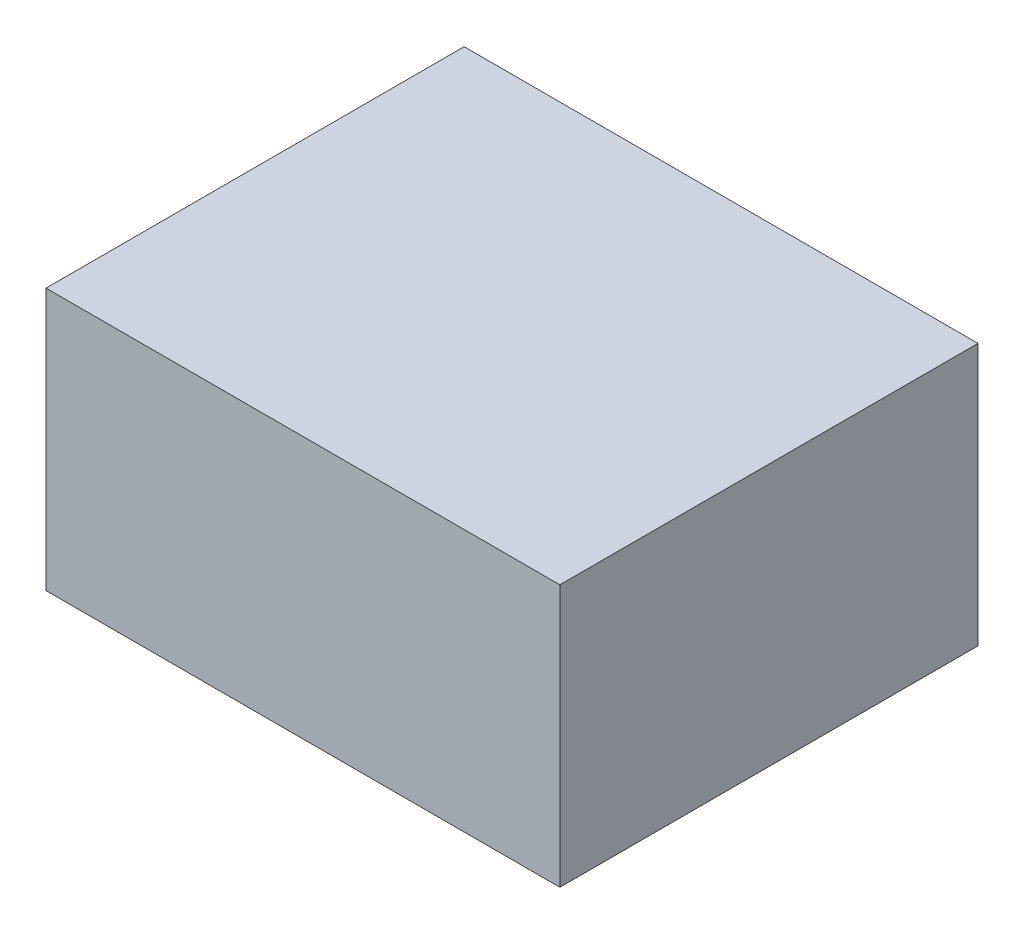
ISO-10303-21;
HEADER;
FILE_DESCRIPTION(('STEP AP214'),'2;1');
FILE_NAME('part.step','',(''),(''),'','','');
FILE_SCHEMA(('AUTOMOTIVE_DESIGN { 1 0 10303 214 1 1 1 1 }'));
ENDSEC;
DATA;
#1=APPLICATION_CONTEXT('core data for automotive mechanical design processes');
#2=APPLICATION_PROTOCOL_DEFINITION('international standard','automotive_design',2000,#1);
#3=PRODUCT_CONTEXT('',#1,'mechanical');
#4=PRODUCT('Part','Part','',(#3));
#5=PRODUCT_RELATED_PRODUCT_CATEGORY('part','',(#4));
#6=PRODUCT_DEFINITION_FORMATION('','',#4);
#7=PRODUCT_DEFINITION_CONTEXT('part definition',#1,'design');
#8=PRODUCT_DEFINITION('design','',#6,#7);
#9=PRODUCT_DEFINITION_SHAPE('','',#8);
#10=(LENGTH_UNIT() NAMED_UNIT(*) SI_UNIT(.MILLI.,.METRE.));
#11=(NAMED_UNIT(*) PLANE_ANGLE_UNIT() SI_UNIT($,.RADIAN.));
#12=(NAMED_UNIT(*) SI_UNIT($,.STERADIAN.) SOLID_ANGLE_UNIT());
#13=UNCERTAINTY_MEASURE_WITH_UNIT(LENGTH_MEASURE(1.E-05),#10,'distance_accuracy_value','');
#14=(GEOMETRIC_REPRESENTATION_CONTEXT(3) GLOBAL_UNCERTAINTY_ASSIGNED_CONTEXT((#13)) GLOBAL_UNIT_ASSIGNED_CONTEXT((#10,
#11,#12)) REPRESENTATION_CONTEXT('',''));
#15=CARTESIAN_POINT('',(0.,0.,0.));
#16=DIRECTION('',(0.,0.,1.));
#17=DIRECTION('',(1.,0.,0.));
#18=AXIS2_PLACEMENT_3D('',#15,#16,#17);
#19=CARTESIAN_POINT('',(25.5,-13.,41.5));
#20=DIRECTION('',(-1.,0.,0.));
#21=DIRECTION('',(0.,0.,1.));
#22=AXIS2_PLACEMENT_3D('',#19,#20,#21);
#23=PLANE('',#22);
#24=DIRECTION('',(0.,1.,0.));
#25=VECTOR('',#24,1.);
#26=CARTESIAN_POINT('',(25.5,-13.,0.));
#27=LINE('',#26,#25);
#28=CARTESIAN_POINT('',(25.5,-13.,0.));
#29=VERTEX_POINT('',#28);
#30=CARTESIAN_POINT('',(25.5,13.,0.));
#31=VERTEX_POINT('',#30);
#32=EDGE_CURVE('E96',#29,#31,#27,.T.);
#33=ORIENTED_EDGE('',*,*,#32,.T.);
#34=DIRECTION('',(0.,0.,-1.));
#35=VECTOR('',#34,1.);
#36=CARTESIAN_POINT('',(25.5,13.,41.5));
#37=LINE('',#36,#35);
#38=CARTESIAN_POINT('',(25.5,13.,41.5));
#39=VERTEX_POINT('',#38);
#40=EDGE_CURVE('E11',#39,#31,#37,.T.);
#41=ORIENTED_EDGE('',*,*,#40,.F.);
#42=DIRECTION('',(0.,1.,0.));
#43=VECTOR('',#42,1.);
#44=CARTESIAN_POINT('',(25.5,-13.,41.5));
#45=LINE('',#44,#43);
#46=CARTESIAN_POINT('',(25.5,-13.,41.5));
#47=VERTEX_POINT('',#46);
#48=EDGE_CURVE('E84',#47,#39,#45,.T.);
#49=ORIENTED_EDGE('',*,*,#48,.F.);
#50=DIRECTION('',(0.,0.,-1.));
#51=VECTOR('',#50,1.);
#52=CARTESIAN_POINT('',(25.5,-13.,41.5));
#53=LINE('',#52,#51);
#54=EDGE_CURVE('E92',#47,#29,#53,.T.);
#55=ORIENTED_EDGE('',*,*,#54,.T.);
#56=EDGE_LOOP('',(#33,#41,#49,#55));
#57=FACE_BOUND('',#56,.T.);
#58=ADVANCED_FACE('F33',(#57),#23,.F.);
#59=CARTESIAN_POINT('',(-25.5,13.,41.5));
#60=DIRECTION('',(0.,-1.,0.));
#61=DIRECTION('',(0.,0.,-1.));
#62=AXIS2_PLACEMENT_3D('',#59,#60,#61);
#63=PLANE('',#62);
#64=DIRECTION('',(-1.,0.,0.));
#65=VECTOR('',#64,1.);
#66=CARTESIAN_POINT('',(-25.5,13.,0.));
#67=LINE('',#66,#65);
#68=CARTESIAN_POINT('',(-25.5,13.,0.));
#69=VERTEX_POINT('',#68);
#70=EDGE_CURVE('E88',#31,#69,#67,.T.);
#71=ORIENTED_EDGE('',*,*,#70,.T.);
#72=DIRECTION('',(0.,0.,-1.));
#73=VECTOR('',#72,1.);
#74=CARTESIAN_POINT('',(-25.5,13.,41.5));
#75=LINE('',#74,#73);
#76=CARTESIAN_POINT('',(-25.5,13.,41.5));
#77=VERTEX_POINT('',#76);
#78=EDGE_CURVE('E41',#77,#69,#75,.T.);
#79=ORIENTED_EDGE('',*,*,#78,.F.);
#80=DIRECTION('',(-1.,0.,0.));
#81=VECTOR('',#80,1.);
#82=CARTESIAN_POINT('',(-25.5,13.,41.5));
#83=LINE('',#82,#81);
#84=EDGE_CURVE('E79',#39,#77,#83,.T.);
#85=ORIENTED_EDGE('',*,*,#84,.F.);
#86=ORIENTED_EDGE('',*,*,#40,.T.);
#87=EDGE_LOOP('',(#71,#79,#85,#86));
#88=FACE_BOUND('',#87,.T.);
#89=ADVANCED_FACE('F87',(#88),#63,.F.);
#90=CARTESIAN_POINT('',(-25.5,-13.,41.5));
#91=DIRECTION('',(1.,0.,0.));
#92=DIRECTION('',(0.,0.,-1.));
#93=AXIS2_PLACEMENT_3D('',#90,#91,#92);
#94=PLANE('',#93);
#95=DIRECTION('',(0.,-1.,0.));
#96=VECTOR('',#95,1.);
#97=CARTESIAN_POINT('',(-25.5,-13.,0.));
#98=LINE('',#97,#96);
#99=CARTESIAN_POINT('',(-25.5,-13.,0.));
#100=VERTEX_POINT('',#99);
#101=EDGE_CURVE('E66',#69,#100,#98,.T.);
#102=ORIENTED_EDGE('',*,*,#101,.T.);
#103=DIRECTION('',(0.,0.,-1.));
#104=VECTOR('',#103,1.);
#105=CARTESIAN_POINT('',(-25.5,-13.,41.5));
#106=LINE('',#105,#104);
#107=CARTESIAN_POINT('',(-25.5,-13.,41.5));
#108=VERTEX_POINT('',#107);
#109=EDGE_CURVE('E89',#108,#100,#106,.T.);
#110=ORIENTED_EDGE('',*,*,#109,.F.);
#111=DIRECTION('',(0.,-1.,0.));
#112=VECTOR('',#111,1.);
#113=CARTESIAN_POINT('',(-25.5,-13.,41.5));
#114=LINE('',#113,#112);
#115=EDGE_CURVE('E82',#77,#108,#114,.T.);
#116=ORIENTED_EDGE('',*,*,#115,.F.);
#117=ORIENTED_EDGE('',*,*,#78,.T.);
#118=EDGE_LOOP('',(#102,#110,#116,#117));
#119=FACE_BOUND('',#118,.T.);
#120=ADVANCED_FACE('F90',(#119),#94,.F.);
#121=CARTESIAN_POINT('',(-25.5,-13.,41.5));
#122=DIRECTION('',(0.,1.,0.));
#123=DIRECTION('',(0.,0.,1.));
#124=AXIS2_PLACEMENT_3D('',#121,#122,#123);
#125=PLANE('',#124);
#126=DIRECTION('',(1.,0.,0.));
#127=VECTOR('',#126,1.);
#128=CARTESIAN_POINT('',(-25.5,-13.,0.));
#129=LINE('',#128,#127);
#130=EDGE_CURVE('E72',#100,#29,#129,.T.);
#131=ORIENTED_EDGE('',*,*,#130,.T.);
#132=ORIENTED_EDGE('',*,*,#54,.F.);
#133=DIRECTION('',(1.,0.,0.));
#134=VECTOR('',#133,1.);
#135=CARTESIAN_POINT('',(-25.5,-13.,41.5));
#136=LINE('',#135,#134);
#137=EDGE_CURVE('E49',#108,#47,#136,.T.);
#138=ORIENTED_EDGE('',*,*,#137,.F.);
#139=ORIENTED_EDGE('',*,*,#109,.T.);
#140=EDGE_LOOP('',(#131,#132,#138,#139));
#141=FACE_BOUND('',#140,.T.);
#142=ADVANCED_FACE('F103',(#141),#125,.F.);
#143=CARTESIAN_POINT('',(0.,0.,41.5));
#144=DIRECTION('',(0.,0.,-1.));
#145=DIRECTION('',(-1.,0.,0.));
#146=AXIS2_PLACEMENT_3D('',#143,#144,#145);
#147=PLANE('',#146);
#148=ORIENTED_EDGE('',*,*,#48,.T.);
#149=ORIENTED_EDGE('',*,*,#84,.T.);
#150=ORIENTED_EDGE('',*,*,#115,.T.);
#151=ORIENTED_EDGE('',*,*,#137,.T.);
#152=EDGE_LOOP('',(#148,#149,#150,#151));
#153=FACE_BOUND('',#152,.T.);
#154=ADVANCED_FACE('F80',(#153),#147,.F.);
#155=CARTESIAN_POINT('',(0.,0.,0.));
#156=DIRECTION('',(0.,0.,-1.));
#157=DIRECTION('',(-1.,0.,0.));
#158=AXIS2_PLACEMENT_3D('',#155,#156,#157);
#159=PLANE('',#158);
#160=ORIENTED_EDGE('',*,*,#32,.F.);
#161=ORIENTED_EDGE('',*,*,#130,.F.);
#162=ORIENTED_EDGE('',*,*,#101,.F.);
#163=ORIENTED_EDGE('',*,*,#70,.F.);
#164=EDGE_LOOP('',(#160,#161,#162,#163));
#165=FACE_BOUND('',#164,.T.);
#166=ADVANCED_FACE('F106',(#165),#159,.T.);
#167=CLOSED_SHELL('',(#58,#89,#120,#142,#154,#166));
#168=MANIFOLD_SOLID_BREP('B2',#167);
#169=ADVANCED_BREP_SHAPE_REPRESENTATION('',(#18,#168),#14);
#170=SHAPE_DEFINITION_REPRESENTATION(#9,#169);
ENDSEC;
END-ISO-10303-21;
